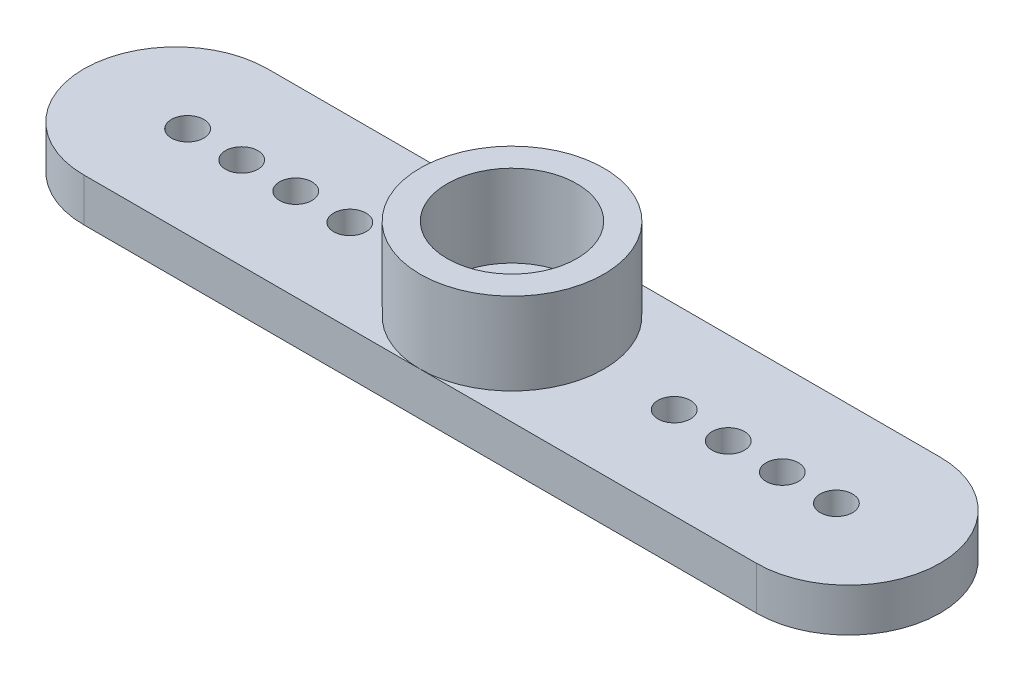
ISO-10303-21;
HEADER;
FILE_DESCRIPTION(('STEP AP214'),'2;1');
FILE_NAME('part.step','',(''),(''),'','','');
FILE_SCHEMA(('AUTOMOTIVE_DESIGN { 1 0 10303 214 1 1 1 1 }'));
ENDSEC;
DATA;
#1=APPLICATION_CONTEXT('core data for automotive mechanical design processes');
#2=APPLICATION_PROTOCOL_DEFINITION('international standard','automotive_design',2000,#1);
#3=PRODUCT_CONTEXT('',#1,'mechanical');
#4=PRODUCT('Part','Part','',(#3));
#5=PRODUCT_RELATED_PRODUCT_CATEGORY('part','',(#4));
#6=PRODUCT_DEFINITION_FORMATION('','',#4);
#7=PRODUCT_DEFINITION_CONTEXT('part definition',#1,'design');
#8=PRODUCT_DEFINITION('design','',#6,#7);
#9=PRODUCT_DEFINITION_SHAPE('','',#8);
#10=(LENGTH_UNIT() NAMED_UNIT(*) SI_UNIT(.MILLI.,.METRE.));
#11=(NAMED_UNIT(*) PLANE_ANGLE_UNIT() SI_UNIT($,.RADIAN.));
#12=(NAMED_UNIT(*) SI_UNIT($,.STERADIAN.) SOLID_ANGLE_UNIT());
#13=UNCERTAINTY_MEASURE_WITH_UNIT(LENGTH_MEASURE(1.E-05),#10,'distance_accuracy_value','');
#14=(GEOMETRIC_REPRESENTATION_CONTEXT(3) GLOBAL_UNCERTAINTY_ASSIGNED_CONTEXT((#13)) GLOBAL_UNIT_ASSIGNED_CONTEXT((#10,
#11,#12)) REPRESENTATION_CONTEXT('',''));
#15=CARTESIAN_POINT('',(0.,0.,0.));
#16=DIRECTION('',(0.,0.,1.));
#17=DIRECTION('',(1.,0.,0.));
#18=AXIS2_PLACEMENT_3D('',#15,#16,#17);
#19=CARTESIAN_POINT('',(0.,2.,0.));
#20=DIRECTION('',(0.,1.,0.));
#21=DIRECTION('',(0.,0.,1.));
#22=AXIS2_PLACEMENT_3D('',#19,#20,#21);
#23=PLANE('',#22);
#24=CARTESIAN_POINT('',(15.55,2.,0.));
#25=DIRECTION('',(0.,1.,0.));
#26=DIRECTION('',(0.,0.,1.));
#27=AXIS2_PLACEMENT_3D('',#24,#25,#26);
#28=CIRCLE('',#27,4.25);
#29=CARTESIAN_POINT('',(15.55,2.,4.25));
#30=VERTEX_POINT('',#29);
#31=CARTESIAN_POINT('',(15.55,2.,-4.25));
#32=VERTEX_POINT('',#31);
#33=EDGE_CURVE('E56',#30,#32,#28,.T.);
#34=ORIENTED_EDGE('',*,*,#33,.F.);
#35=DIRECTION('',(1.,0.,0.));
#36=VECTOR('',#35,1.);
#37=CARTESIAN_POINT('',(0.,2.,4.25));
#38=LINE('',#37,#36);
#39=CARTESIAN_POINT('',(31.1,2.,4.25));
#40=VERTEX_POINT('',#39);
#41=EDGE_CURVE('E104',#30,#40,#38,.T.);
#42=ORIENTED_EDGE('',*,*,#41,.T.);
#43=CARTESIAN_POINT('',(31.1,2.,0.));
#44=DIRECTION('',(0.,1.,0.));
#45=DIRECTION('',(0.,0.,1.));
#46=AXIS2_PLACEMENT_3D('',#43,#44,#45);
#47=CIRCLE('',#46,4.25);
#48=CARTESIAN_POINT('',(31.1,2.,-4.25));
#49=VERTEX_POINT('',#48);
#50=EDGE_CURVE('E103',#40,#49,#47,.T.);
#51=ORIENTED_EDGE('',*,*,#50,.T.);
#52=DIRECTION('',(-1.,0.,0.));
#53=VECTOR('',#52,1.);
#54=CARTESIAN_POINT('',(0.,2.,-4.25));
#55=LINE('',#54,#53);
#56=EDGE_CURVE('E117',#49,#32,#55,.T.);
#57=ORIENTED_EDGE('',*,*,#56,.T.);
#58=EDGE_LOOP('',(#34,#42,#51,#57));
#59=FACE_BOUND('',#58,.T.);
#60=CARTESIAN_POINT('',(28.05,2.,0.));
#61=DIRECTION('',(0.,1.,0.));
#62=DIRECTION('',(0.,0.,1.));
#63=AXIS2_PLACEMENT_3D('',#60,#61,#62);
#64=CIRCLE('',#63,0.750000000000002);
#65=CARTESIAN_POINT('',(28.05,2.,0.750000000000002));
#66=VERTEX_POINT('',#65);
#67=EDGE_CURVE('E200',#66,#66,#64,.T.);
#68=ORIENTED_EDGE('',*,*,#67,.F.);
#69=EDGE_LOOP('',(#68));
#70=FACE_BOUND('',#69,.T.);
#71=CARTESIAN_POINT('',(23.05,2.,0.));
#72=DIRECTION('',(0.,1.,0.));
#73=DIRECTION('',(0.,0.,1.));
#74=AXIS2_PLACEMENT_3D('',#71,#72,#73);
#75=CIRCLE('',#74,0.750000000000002);
#76=CARTESIAN_POINT('',(23.05,2.,0.750000000000002));
#77=VERTEX_POINT('',#76);
#78=EDGE_CURVE('E189',#77,#77,#75,.T.);
#79=ORIENTED_EDGE('',*,*,#78,.F.);
#80=EDGE_LOOP('',(#79));
#81=FACE_BOUND('',#80,.T.);
#82=CARTESIAN_POINT('',(25.55,2.,0.));
#83=DIRECTION('',(0.,1.,0.));
#84=DIRECTION('',(0.,0.,1.));
#85=AXIS2_PLACEMENT_3D('',#82,#83,#84);
#86=CIRCLE('',#85,0.750000000000002);
#87=CARTESIAN_POINT('',(25.55,2.,0.750000000000002));
#88=VERTEX_POINT('',#87);
#89=EDGE_CURVE('E194',#88,#88,#86,.T.);
#90=ORIENTED_EDGE('',*,*,#89,.F.);
#91=EDGE_LOOP('',(#90));
#92=FACE_BOUND('',#91,.T.);
#93=CARTESIAN_POINT('',(30.55,2.,0.));
#94=DIRECTION('',(0.,1.,0.));
#95=DIRECTION('',(0.,0.,1.));
#96=AXIS2_PLACEMENT_3D('',#93,#94,#95);
#97=CIRCLE('',#96,0.750000000000005);
#98=CARTESIAN_POINT('',(30.55,2.,0.750000000000005));
#99=VERTEX_POINT('',#98);
#100=EDGE_CURVE('E206',#99,#99,#97,.T.);
#101=ORIENTED_EDGE('',*,*,#100,.F.);
#102=EDGE_LOOP('',(#101));
#103=FACE_BOUND('',#102,.T.);
#104=ADVANCED_FACE('F46',(#59,#70,#81,#92,#103),#23,.T.);
#105=EDGE_CURVE('E13',#32,#30,#28,.T.);
#106=ORIENTED_EDGE('',*,*,#105,.F.);
#107=CARTESIAN_POINT('',(0.,2.,-4.25));
#108=VERTEX_POINT('',#107);
#109=EDGE_CURVE('E66',#32,#108,#55,.T.);
#110=ORIENTED_EDGE('',*,*,#109,.T.);
#111=CARTESIAN_POINT('',(0.,2.,0.));
#112=DIRECTION('',(0.,1.,0.));
#113=DIRECTION('',(0.,0.,1.));
#114=AXIS2_PLACEMENT_3D('',#111,#112,#113);
#115=CIRCLE('',#114,4.25);
#116=CARTESIAN_POINT('',(0.,2.,4.25));
#117=VERTEX_POINT('',#116);
#118=EDGE_CURVE('E101',#108,#117,#115,.T.);
#119=ORIENTED_EDGE('',*,*,#118,.T.);
#120=EDGE_CURVE('E95',#117,#30,#38,.T.);
#121=ORIENTED_EDGE('',*,*,#120,.T.);
#122=EDGE_LOOP('',(#106,#110,#119,#121));
#123=FACE_BOUND('',#122,.T.);
#124=CARTESIAN_POINT('',(3.05,2.,0.));
#125=DIRECTION('',(0.,1.,0.));
#126=DIRECTION('',(0.,0.,1.));
#127=AXIS2_PLACEMENT_3D('',#124,#125,#126);
#128=CIRCLE('',#127,0.75);
#129=CARTESIAN_POINT('',(3.05,2.,0.750000000000035));
#130=VERTEX_POINT('',#129);
#131=EDGE_CURVE('E218',#130,#130,#128,.T.);
#132=ORIENTED_EDGE('',*,*,#131,.F.);
#133=EDGE_LOOP('',(#132));
#134=FACE_BOUND('',#133,.T.);
#135=CARTESIAN_POINT('',(8.05,2.,0.));
#136=DIRECTION('',(0.,1.,0.));
#137=DIRECTION('',(0.,0.,1.));
#138=AXIS2_PLACEMENT_3D('',#135,#136,#137);
#139=CIRCLE('',#138,0.75);
#140=CARTESIAN_POINT('',(8.05,2.,0.75));
#141=VERTEX_POINT('',#140);
#142=EDGE_CURVE('E169',#141,#141,#139,.T.);
#143=ORIENTED_EDGE('',*,*,#142,.F.);
#144=EDGE_LOOP('',(#143));
#145=FACE_BOUND('',#144,.T.);
#146=CARTESIAN_POINT('',(5.55,2.,0.));
#147=DIRECTION('',(0.,1.,0.));
#148=DIRECTION('',(0.,0.,1.));
#149=AXIS2_PLACEMENT_3D('',#146,#147,#148);
#150=CIRCLE('',#149,0.75);
#151=CARTESIAN_POINT('',(5.55,2.,0.750000000000018));
#152=VERTEX_POINT('',#151);
#153=EDGE_CURVE('E212',#152,#152,#150,.T.);
#154=ORIENTED_EDGE('',*,*,#153,.F.);
#155=EDGE_LOOP('',(#154));
#156=FACE_BOUND('',#155,.T.);
#157=CARTESIAN_POINT('',(0.550000000000004,2.,0.));
#158=DIRECTION('',(0.,1.,0.));
#159=DIRECTION('',(0.,0.,1.));
#160=AXIS2_PLACEMENT_3D('',#157,#158,#159);
#161=CIRCLE('',#160,0.75);
#162=CARTESIAN_POINT('',(0.550000000000004,2.,0.750000000000053));
#163=VERTEX_POINT('',#162);
#164=EDGE_CURVE('E224',#163,#163,#161,.T.);
#165=ORIENTED_EDGE('',*,*,#164,.F.);
#166=EDGE_LOOP('',(#165));
#167=FACE_BOUND('',#166,.T.);
#168=ADVANCED_FACE('F98',(#123,#134,#145,#156,#167),#23,.T.);
#169=CARTESIAN_POINT('',(0.,0.,0.));
#170=DIRECTION('',(0.,1.,0.));
#171=DIRECTION('',(0.,0.,1.));
#172=AXIS2_PLACEMENT_3D('',#169,#170,#171);
#173=PLANE('',#172);
#174=CARTESIAN_POINT('',(0.,0.,0.));
#175=DIRECTION('',(0.,1.,0.));
#176=DIRECTION('',(0.,0.,1.));
#177=AXIS2_PLACEMENT_3D('',#174,#175,#176);
#178=CIRCLE('',#177,4.25);
#179=CARTESIAN_POINT('',(0.,0.,-4.25));
#180=VERTEX_POINT('',#179);
#181=CARTESIAN_POINT('',(0.,0.,4.25));
#182=VERTEX_POINT('',#181);
#183=EDGE_CURVE('E166',#180,#182,#178,.T.);
#184=ORIENTED_EDGE('',*,*,#183,.F.);
#185=DIRECTION('',(-1.,0.,0.));
#186=VECTOR('',#185,1.);
#187=CARTESIAN_POINT('',(0.,0.,-4.25));
#188=LINE('',#187,#186);
#189=CARTESIAN_POINT('',(31.1,0.,-4.25));
#190=VERTEX_POINT('',#189);
#191=EDGE_CURVE('E88',#190,#180,#188,.T.);
#192=ORIENTED_EDGE('',*,*,#191,.F.);
#193=CARTESIAN_POINT('',(31.1,0.,0.));
#194=DIRECTION('',(0.,1.,0.));
#195=DIRECTION('',(0.,0.,1.));
#196=AXIS2_PLACEMENT_3D('',#193,#194,#195);
#197=CIRCLE('',#196,4.25);
#198=CARTESIAN_POINT('',(31.1,0.,4.25));
#199=VERTEX_POINT('',#198);
#200=EDGE_CURVE('E171',#199,#190,#197,.T.);
#201=ORIENTED_EDGE('',*,*,#200,.F.);
#202=DIRECTION('',(1.,0.,0.));
#203=VECTOR('',#202,1.);
#204=CARTESIAN_POINT('',(0.,0.,4.25));
#205=LINE('',#204,#203);
#206=EDGE_CURVE('E168',#182,#199,#205,.T.);
#207=ORIENTED_EDGE('',*,*,#206,.F.);
#208=EDGE_LOOP('',(#184,#192,#201,#207));
#209=FACE_BOUND('',#208,.T.);
#210=CARTESIAN_POINT('',(8.05,0.,0.));
#211=DIRECTION('',(0.,1.,0.));
#212=DIRECTION('',(0.,0.,1.));
#213=AXIS2_PLACEMENT_3D('',#210,#211,#212);
#214=CIRCLE('',#213,0.75);
#215=CARTESIAN_POINT('',(8.05,0.,0.75));
#216=VERTEX_POINT('',#215);
#217=EDGE_CURVE('E174',#216,#216,#214,.T.);
#218=ORIENTED_EDGE('',*,*,#217,.T.);
#219=EDGE_LOOP('',(#218));
#220=FACE_BOUND('',#219,.T.);
#221=CARTESIAN_POINT('',(23.05,0.,0.));
#222=DIRECTION('',(0.,1.,0.));
#223=DIRECTION('',(0.,0.,1.));
#224=AXIS2_PLACEMENT_3D('',#221,#222,#223);
#225=CIRCLE('',#224,0.750000000000002);
#226=CARTESIAN_POINT('',(23.05,0.,0.750000000000002));
#227=VERTEX_POINT('',#226);
#228=EDGE_CURVE('E191',#227,#227,#225,.T.);
#229=ORIENTED_EDGE('',*,*,#228,.T.);
#230=EDGE_LOOP('',(#229));
#231=FACE_BOUND('',#230,.T.);
#232=CARTESIAN_POINT('',(25.55,0.,0.));
#233=DIRECTION('',(0.,1.,0.));
#234=DIRECTION('',(0.,0.,1.));
#235=AXIS2_PLACEMENT_3D('',#232,#233,#234);
#236=CIRCLE('',#235,0.750000000000002);
#237=CARTESIAN_POINT('',(25.55,0.,0.750000000000002));
#238=VERTEX_POINT('',#237);
#239=EDGE_CURVE('E197',#238,#238,#236,.T.);
#240=ORIENTED_EDGE('',*,*,#239,.T.);
#241=EDGE_LOOP('',(#240));
#242=FACE_BOUND('',#241,.T.);
#243=CARTESIAN_POINT('',(28.05,0.,0.));
#244=DIRECTION('',(0.,1.,0.));
#245=DIRECTION('',(0.,0.,1.));
#246=AXIS2_PLACEMENT_3D('',#243,#244,#245);
#247=CIRCLE('',#246,0.750000000000002);
#248=CARTESIAN_POINT('',(28.05,0.,0.750000000000002));
#249=VERTEX_POINT('',#248);
#250=EDGE_CURVE('E203',#249,#249,#247,.T.);
#251=ORIENTED_EDGE('',*,*,#250,.T.);
#252=EDGE_LOOP('',(#251));
#253=FACE_BOUND('',#252,.T.);
#254=CARTESIAN_POINT('',(30.55,0.,0.));
#255=DIRECTION('',(0.,1.,0.));
#256=DIRECTION('',(0.,0.,1.));
#257=AXIS2_PLACEMENT_3D('',#254,#255,#256);
#258=CIRCLE('',#257,0.750000000000005);
#259=CARTESIAN_POINT('',(30.55,0.,0.750000000000005));
#260=VERTEX_POINT('',#259);
#261=EDGE_CURVE('E209',#260,#260,#258,.T.);
#262=ORIENTED_EDGE('',*,*,#261,.T.);
#263=EDGE_LOOP('',(#262));
#264=FACE_BOUND('',#263,.T.);
#265=CARTESIAN_POINT('',(5.55,0.,0.));
#266=DIRECTION('',(0.,1.,0.));
#267=DIRECTION('',(0.,0.,1.));
#268=AXIS2_PLACEMENT_3D('',#265,#266,#267);
#269=CIRCLE('',#268,0.75);
#270=CARTESIAN_POINT('',(5.55,0.,0.750000000000018));
#271=VERTEX_POINT('',#270);
#272=EDGE_CURVE('E215',#271,#271,#269,.T.);
#273=ORIENTED_EDGE('',*,*,#272,.T.);
#274=EDGE_LOOP('',(#273));
#275=FACE_BOUND('',#274,.T.);
#276=CARTESIAN_POINT('',(3.05,0.,0.));
#277=DIRECTION('',(0.,1.,0.));
#278=DIRECTION('',(0.,0.,1.));
#279=AXIS2_PLACEMENT_3D('',#276,#277,#278);
#280=CIRCLE('',#279,0.75);
#281=CARTESIAN_POINT('',(3.05,0.,0.750000000000035));
#282=VERTEX_POINT('',#281);
#283=EDGE_CURVE('E221',#282,#282,#280,.T.);
#284=ORIENTED_EDGE('',*,*,#283,.T.);
#285=EDGE_LOOP('',(#284));
#286=FACE_BOUND('',#285,.T.);
#287=CARTESIAN_POINT('',(0.550000000000004,0.,0.));
#288=DIRECTION('',(0.,1.,0.));
#289=DIRECTION('',(0.,0.,1.));
#290=AXIS2_PLACEMENT_3D('',#287,#288,#289);
#291=CIRCLE('',#290,0.75);
#292=CARTESIAN_POINT('',(0.550000000000004,0.,0.750000000000053));
#293=VERTEX_POINT('',#292);
#294=EDGE_CURVE('E227',#293,#293,#291,.T.);
#295=ORIENTED_EDGE('',*,*,#294,.T.);
#296=EDGE_LOOP('',(#295));
#297=FACE_BOUND('',#296,.T.);
#298=ADVANCED_FACE('F143',(#209,#220,#231,#242,#253,#264,#275,#286,#297),#173,.F.);
#299=CARTESIAN_POINT('',(0.,2.,0.));
#300=DIRECTION('',(0.,-1.,0.));
#301=DIRECTION('',(0.,0.,-1.));
#302=AXIS2_PLACEMENT_3D('',#299,#300,#301);
#303=CYLINDRICAL_SURFACE('',#302,4.25);
#304=ORIENTED_EDGE('',*,*,#183,.T.);
#305=DIRECTION('',(0.,-1.,0.));
#306=VECTOR('',#305,1.);
#307=CARTESIAN_POINT('',(0.,2.,4.25));
#308=LINE('',#307,#306);
#309=EDGE_CURVE('E50',#117,#182,#308,.T.);
#310=ORIENTED_EDGE('',*,*,#309,.F.);
#311=ORIENTED_EDGE('',*,*,#118,.F.);
#312=DIRECTION('',(0.,-1.,0.));
#313=VECTOR('',#312,1.);
#314=CARTESIAN_POINT('',(0.,2.,-4.25));
#315=LINE('',#314,#313);
#316=EDGE_CURVE('E167',#108,#180,#315,.T.);
#317=ORIENTED_EDGE('',*,*,#316,.T.);
#318=EDGE_LOOP('',(#304,#310,#311,#317));
#319=FACE_BOUND('',#318,.T.);
#320=ADVANCED_FACE('F48',(#319),#303,.T.);
#321=CARTESIAN_POINT('',(0.,2.,4.25));
#322=DIRECTION('',(0.,0.,-1.));
#323=DIRECTION('',(-1.,0.,0.));
#324=AXIS2_PLACEMENT_3D('',#321,#322,#323);
#325=PLANE('',#324);
#326=ORIENTED_EDGE('',*,*,#206,.T.);
#327=DIRECTION('',(0.,-1.,0.));
#328=VECTOR('',#327,1.);
#329=CARTESIAN_POINT('',(31.1,2.,4.25));
#330=LINE('',#329,#328);
#331=EDGE_CURVE('E110',#40,#199,#330,.T.);
#332=ORIENTED_EDGE('',*,*,#331,.F.);
#333=ORIENTED_EDGE('',*,*,#41,.F.);
#334=ORIENTED_EDGE('',*,*,#120,.F.);
#335=ORIENTED_EDGE('',*,*,#309,.T.);
#336=EDGE_LOOP('',(#326,#332,#333,#334,#335));
#337=FACE_BOUND('',#336,.T.);
#338=ADVANCED_FACE('F108',(#337),#325,.F.);
#339=CARTESIAN_POINT('',(31.1,2.,0.));
#340=DIRECTION('',(0.,-1.,0.));
#341=DIRECTION('',(0.,0.,-1.));
#342=AXIS2_PLACEMENT_3D('',#339,#340,#341);
#343=CYLINDRICAL_SURFACE('',#342,4.25);
#344=ORIENTED_EDGE('',*,*,#200,.T.);
#345=DIRECTION('',(0.,-1.,0.));
#346=VECTOR('',#345,1.);
#347=CARTESIAN_POINT('',(31.1,2.,-4.25));
#348=LINE('',#347,#346);
#349=EDGE_CURVE('E182',#49,#190,#348,.T.);
#350=ORIENTED_EDGE('',*,*,#349,.F.);
#351=ORIENTED_EDGE('',*,*,#50,.F.);
#352=ORIENTED_EDGE('',*,*,#331,.T.);
#353=EDGE_LOOP('',(#344,#350,#351,#352));
#354=FACE_BOUND('',#353,.T.);
#355=ADVANCED_FACE('F154',(#354),#343,.T.);
#356=CARTESIAN_POINT('',(0.,2.,-4.25));
#357=DIRECTION('',(0.,0.,1.));
#358=DIRECTION('',(1.,0.,0.));
#359=AXIS2_PLACEMENT_3D('',#356,#357,#358);
#360=PLANE('',#359);
#361=ORIENTED_EDGE('',*,*,#191,.T.);
#362=ORIENTED_EDGE('',*,*,#316,.F.);
#363=ORIENTED_EDGE('',*,*,#109,.F.);
#364=ORIENTED_EDGE('',*,*,#56,.F.);
#365=ORIENTED_EDGE('',*,*,#349,.T.);
#366=EDGE_LOOP('',(#361,#362,#363,#364,#365));
#367=FACE_BOUND('',#366,.T.);
#368=ADVANCED_FACE('F151',(#367),#360,.F.);
#369=CARTESIAN_POINT('',(8.05,2.,0.));
#370=DIRECTION('',(0.,-1.,0.));
#371=DIRECTION('',(0.,0.,-1.));
#372=AXIS2_PLACEMENT_3D('',#369,#370,#371);
#373=CYLINDRICAL_SURFACE('',#372,0.75);
#374=ORIENTED_EDGE('',*,*,#142,.T.);
#375=EDGE_LOOP('',(#374));
#376=FACE_BOUND('',#375,.T.);
#377=ORIENTED_EDGE('',*,*,#217,.F.);
#378=EDGE_LOOP('',(#377));
#379=FACE_BOUND('',#378,.T.);
#380=ADVANCED_FACE('F146',(#376,#379),#373,.F.);
#381=CARTESIAN_POINT('',(23.05,2.,0.));
#382=DIRECTION('',(0.,-1.,0.));
#383=DIRECTION('',(0.,0.,-1.));
#384=AXIS2_PLACEMENT_3D('',#381,#382,#383);
#385=CYLINDRICAL_SURFACE('',#384,0.750000000000002);
#386=ORIENTED_EDGE('',*,*,#78,.T.);
#387=EDGE_LOOP('',(#386));
#388=FACE_BOUND('',#387,.T.);
#389=ORIENTED_EDGE('',*,*,#228,.F.);
#390=EDGE_LOOP('',(#389));
#391=FACE_BOUND('',#390,.T.);
#392=ADVANCED_FACE('F347',(#388,#391),#385,.F.);
#393=CARTESIAN_POINT('',(25.55,2.,0.));
#394=DIRECTION('',(0.,-1.,0.));
#395=DIRECTION('',(0.,0.,-1.));
#396=AXIS2_PLACEMENT_3D('',#393,#394,#395);
#397=CYLINDRICAL_SURFACE('',#396,0.750000000000002);
#398=ORIENTED_EDGE('',*,*,#89,.T.);
#399=EDGE_LOOP('',(#398));
#400=FACE_BOUND('',#399,.T.);
#401=ORIENTED_EDGE('',*,*,#239,.F.);
#402=EDGE_LOOP('',(#401));
#403=FACE_BOUND('',#402,.T.);
#404=ADVANCED_FACE('F337',(#400,#403),#397,.F.);
#405=CARTESIAN_POINT('',(28.05,2.,0.));
#406=DIRECTION('',(0.,-1.,0.));
#407=DIRECTION('',(0.,0.,-1.));
#408=AXIS2_PLACEMENT_3D('',#405,#406,#407);
#409=CYLINDRICAL_SURFACE('',#408,0.750000000000002);
#410=ORIENTED_EDGE('',*,*,#67,.T.);
#411=EDGE_LOOP('',(#410));
#412=FACE_BOUND('',#411,.T.);
#413=ORIENTED_EDGE('',*,*,#250,.F.);
#414=EDGE_LOOP('',(#413));
#415=FACE_BOUND('',#414,.T.);
#416=ADVANCED_FACE('F327',(#412,#415),#409,.F.);
#417=CARTESIAN_POINT('',(30.55,2.,0.));
#418=DIRECTION('',(0.,-1.,0.));
#419=DIRECTION('',(0.,0.,-1.));
#420=AXIS2_PLACEMENT_3D('',#417,#418,#419);
#421=CYLINDRICAL_SURFACE('',#420,0.750000000000005);
#422=ORIENTED_EDGE('',*,*,#100,.T.);
#423=EDGE_LOOP('',(#422));
#424=FACE_BOUND('',#423,.T.);
#425=ORIENTED_EDGE('',*,*,#261,.F.);
#426=EDGE_LOOP('',(#425));
#427=FACE_BOUND('',#426,.T.);
#428=ADVANCED_FACE('F317',(#424,#427),#421,.F.);
#429=CARTESIAN_POINT('',(5.55,2.,0.));
#430=DIRECTION('',(0.,-1.,0.));
#431=DIRECTION('',(0.,0.,-1.));
#432=AXIS2_PLACEMENT_3D('',#429,#430,#431);
#433=CYLINDRICAL_SURFACE('',#432,0.75);
#434=ORIENTED_EDGE('',*,*,#153,.T.);
#435=EDGE_LOOP('',(#434));
#436=FACE_BOUND('',#435,.T.);
#437=ORIENTED_EDGE('',*,*,#272,.F.);
#438=EDGE_LOOP('',(#437));
#439=FACE_BOUND('',#438,.T.);
#440=ADVANCED_FACE('F307',(#436,#439),#433,.F.);
#441=CARTESIAN_POINT('',(3.05,2.,0.));
#442=DIRECTION('',(0.,-1.,0.));
#443=DIRECTION('',(0.,0.,-1.));
#444=AXIS2_PLACEMENT_3D('',#441,#442,#443);
#445=CYLINDRICAL_SURFACE('',#444,0.75);
#446=ORIENTED_EDGE('',*,*,#131,.T.);
#447=EDGE_LOOP('',(#446));
#448=FACE_BOUND('',#447,.T.);
#449=ORIENTED_EDGE('',*,*,#283,.F.);
#450=EDGE_LOOP('',(#449));
#451=FACE_BOUND('',#450,.T.);
#452=ADVANCED_FACE('F134',(#448,#451),#445,.F.);
#453=CARTESIAN_POINT('',(0.550000000000004,2.,0.));
#454=DIRECTION('',(0.,-1.,0.));
#455=DIRECTION('',(0.,0.,-1.));
#456=AXIS2_PLACEMENT_3D('',#453,#454,#455);
#457=CYLINDRICAL_SURFACE('',#456,0.75);
#458=ORIENTED_EDGE('',*,*,#164,.T.);
#459=EDGE_LOOP('',(#458));
#460=FACE_BOUND('',#459,.T.);
#461=ORIENTED_EDGE('',*,*,#294,.F.);
#462=EDGE_LOOP('',(#461));
#463=FACE_BOUND('',#462,.T.);
#464=ADVANCED_FACE('F124',(#460,#463),#457,.F.);
#465=CARTESIAN_POINT('',(15.55,5.8,0.));
#466=DIRECTION('',(0.,-1.,0.));
#467=DIRECTION('',(0.,0.,-1.));
#468=AXIS2_PLACEMENT_3D('',#465,#466,#467);
#469=CYLINDRICAL_SURFACE('',#468,4.25);
#470=CARTESIAN_POINT('',(15.55,5.8,0.));
#471=DIRECTION('',(0.,1.,0.));
#472=DIRECTION('',(0.,0.,1.));
#473=AXIS2_PLACEMENT_3D('',#470,#471,#472);
#474=CIRCLE('',#473,4.25);
#475=CARTESIAN_POINT('',(15.55,5.8,4.25));
#476=VERTEX_POINT('',#475);
#477=EDGE_CURVE('E119',#476,#476,#474,.T.);
#478=ORIENTED_EDGE('',*,*,#477,.F.);
#479=EDGE_LOOP('',(#478));
#480=FACE_BOUND('',#479,.T.);
#481=ORIENTED_EDGE('',*,*,#33,.T.);
#482=ORIENTED_EDGE('',*,*,#105,.T.);
#483=EDGE_LOOP('',(#481,#482));
#484=FACE_BOUND('',#483,.T.);
#485=ADVANCED_FACE('F121',(#480,#484),#469,.T.);
#486=CARTESIAN_POINT('',(15.55,5.8,0.));
#487=DIRECTION('',(0.,1.,0.));
#488=DIRECTION('',(0.,0.,1.));
#489=AXIS2_PLACEMENT_3D('',#486,#487,#488);
#490=PLANE('',#489);
#491=CARTESIAN_POINT('',(15.55,5.8,0.));
#492=DIRECTION('',(0.,1.,0.));
#493=DIRECTION('',(0.,0.,1.));
#494=AXIS2_PLACEMENT_3D('',#491,#492,#493);
#495=CIRCLE('',#494,3.);
#496=CARTESIAN_POINT('',(15.55,5.8,3.));
#497=VERTEX_POINT('',#496);
#498=EDGE_CURVE('E234',#497,#497,#495,.T.);
#499=ORIENTED_EDGE('',*,*,#498,.F.);
#500=EDGE_LOOP('',(#499));
#501=FACE_BOUND('',#500,.T.);
#502=ORIENTED_EDGE('',*,*,#477,.T.);
#503=EDGE_LOOP('',(#502));
#504=FACE_BOUND('',#503,.T.);
#505=ADVANCED_FACE('F123',(#501,#504),#490,.T.);
#506=CARTESIAN_POINT('',(15.55,2.,0.));
#507=DIRECTION('',(0.,1.,0.));
#508=DIRECTION('',(0.,0.,1.));
#509=AXIS2_PLACEMENT_3D('',#506,#507,#508);
#510=CYLINDRICAL_SURFACE('',#509,3.);
#511=CARTESIAN_POINT('',(15.55,2.,0.));
#512=DIRECTION('',(0.,1.,0.));
#513=DIRECTION('',(0.,0.,1.));
#514=AXIS2_PLACEMENT_3D('',#511,#512,#513);
#515=CIRCLE('',#514,3.);
#516=CARTESIAN_POINT('',(15.55,2.,3.));
#517=VERTEX_POINT('',#516);
#518=EDGE_CURVE('E120',#517,#517,#515,.T.);
#519=ORIENTED_EDGE('',*,*,#518,.F.);
#520=EDGE_LOOP('',(#519));
#521=FACE_BOUND('',#520,.T.);
#522=ORIENTED_EDGE('',*,*,#498,.T.);
#523=EDGE_LOOP('',(#522));
#524=FACE_BOUND('',#523,.T.);
#525=ADVANCED_FACE('F131',(#521,#524),#510,.F.);
#526=CARTESIAN_POINT('',(15.55,2.,0.));
#527=DIRECTION('',(0.,1.,0.));
#528=DIRECTION('',(0.,0.,1.));
#529=AXIS2_PLACEMENT_3D('',#526,#527,#528);
#530=PLANE('',#529);
#531=ORIENTED_EDGE('',*,*,#518,.T.);
#532=EDGE_LOOP('',(#531));
#533=FACE_BOUND('',#532,.T.);
#534=ADVANCED_FACE('F240',(#533),#530,.T.);
#535=CLOSED_SHELL('',(#104,#168,#298,#320,#338,#355,#368,#380,#392,#404,#416,#428,#440,#452,
#464,#485,#505,#525,#534));
#536=MANIFOLD_SOLID_BREP('B2',#535);
#537=ADVANCED_BREP_SHAPE_REPRESENTATION('',(#18,#536),#14);
#538=SHAPE_DEFINITION_REPRESENTATION(#9,#537);
ENDSEC;
END-ISO-10303-21;
